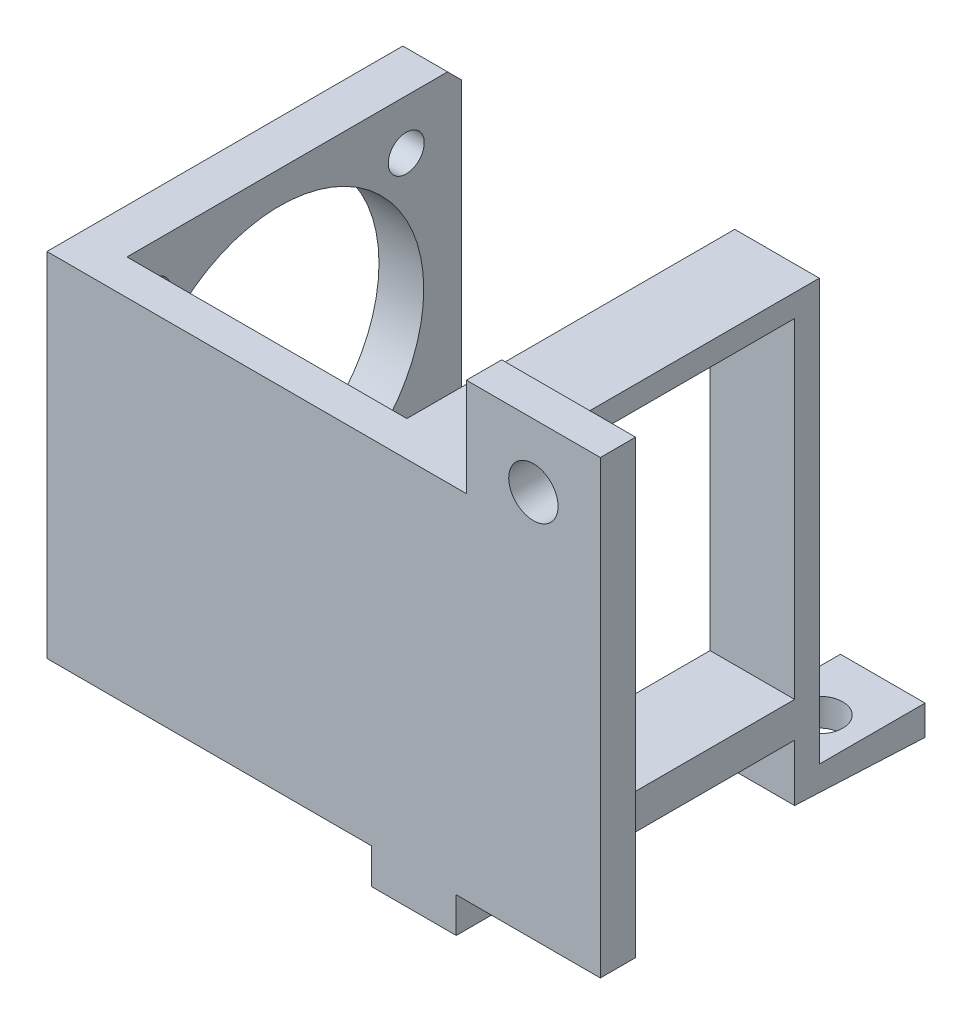
ISO-10303-21;
HEADER;
FILE_DESCRIPTION(('STEP AP214'),'2;1');
FILE_NAME('part.step','',(''),(''),'','','');
FILE_SCHEMA(('AUTOMOTIVE_DESIGN { 1 0 10303 214 1 1 1 1 }'));
ENDSEC;
DATA;
#1=APPLICATION_CONTEXT('core data for automotive mechanical design processes');
#2=APPLICATION_PROTOCOL_DEFINITION('international standard','automotive_design',2000,#1);
#3=PRODUCT_CONTEXT('',#1,'mechanical');
#4=PRODUCT('Part','Part','',(#3));
#5=PRODUCT_RELATED_PRODUCT_CATEGORY('part','',(#4));
#6=PRODUCT_DEFINITION_FORMATION('','',#4);
#7=PRODUCT_DEFINITION_CONTEXT('part definition',#1,'design');
#8=PRODUCT_DEFINITION('design','',#6,#7);
#9=PRODUCT_DEFINITION_SHAPE('','',#8);
#10=(LENGTH_UNIT() NAMED_UNIT(*) SI_UNIT(.MILLI.,.METRE.));
#11=(NAMED_UNIT(*) PLANE_ANGLE_UNIT() SI_UNIT($,.RADIAN.));
#12=(NAMED_UNIT(*) SI_UNIT($,.STERADIAN.) SOLID_ANGLE_UNIT());
#13=UNCERTAINTY_MEASURE_WITH_UNIT(LENGTH_MEASURE(1.E-05),#10,'distance_accuracy_value','');
#14=(GEOMETRIC_REPRESENTATION_CONTEXT(3) GLOBAL_UNCERTAINTY_ASSIGNED_CONTEXT((#13)) GLOBAL_UNIT_ASSIGNED_CONTEXT((#10,
#11,#12)) REPRESENTATION_CONTEXT('',''));
#15=CARTESIAN_POINT('',(0.,0.,0.));
#16=DIRECTION('',(0.,0.,1.));
#17=DIRECTION('',(1.,0.,0.));
#18=AXIS2_PLACEMENT_3D('',#15,#16,#17);
#19=CARTESIAN_POINT('',(0.,0.,0.));
#20=DIRECTION('',(0.,0.,-1.));
#21=DIRECTION('',(-1.,0.,0.));
#22=AXIS2_PLACEMENT_3D('',#19,#20,#21);
#23=PLANE('',#22);
#24=DIRECTION('',(-1.,0.,0.));
#25=VECTOR('',#24,1.);
#26=CARTESIAN_POINT('',(0.,-13.9389851109085,0.));
#27=LINE('',#26,#25);
#28=CARTESIAN_POINT('',(78.5,-13.9389851109085,0.));
#29=VERTEX_POINT('',#28);
#30=CARTESIAN_POINT('',(59.5,-13.9389851109085,0.));
#31=VERTEX_POINT('',#30);
#32=EDGE_CURVE('E473',#29,#31,#27,.T.);
#33=ORIENTED_EDGE('',*,*,#32,.F.);
#34=DIRECTION('',(0.,1.,0.));
#35=VECTOR('',#34,1.);
#36=CARTESIAN_POINT('',(78.5,64.0610148890915,0.));
#37=LINE('',#36,#35);
#38=CARTESIAN_POINT('',(78.5,-77.8779702218171,0.));
#39=VERTEX_POINT('',#38);
#40=EDGE_CURVE('E46',#39,#29,#37,.T.);
#41=ORIENTED_EDGE('',*,*,#40,.F.);
#42=DIRECTION('',(-1.,0.,0.));
#43=VECTOR('',#42,1.);
#44=CARTESIAN_POINT('',(58.0600000000001,-77.8779702218171,0.));
#45=LINE('',#44,#43);
#46=CARTESIAN_POINT('',(58.0600000000001,-77.8779702218171,0.));
#47=VERTEX_POINT('',#46);
#48=EDGE_CURVE('E237',#39,#47,#45,.T.);
#49=ORIENTED_EDGE('',*,*,#48,.T.);
#50=DIRECTION('',(-1.,0.,0.));
#51=VECTOR('',#50,1.);
#52=CARTESIAN_POINT('',(58.0600000000001,-77.8779702218171,0.));
#53=LINE('',#52,#51);
#54=CARTESIAN_POINT('',(46.0600000000001,-77.8779702218171,0.));
#55=VERTEX_POINT('',#54);
#56=EDGE_CURVE('E466',#47,#55,#53,.T.);
#57=ORIENTED_EDGE('',*,*,#56,.T.);
#58=DIRECTION('',(-1.,0.,0.));
#59=VECTOR('',#58,1.);
#60=CARTESIAN_POINT('',(0.,-77.8779702218171,0.));
#61=LINE('',#60,#59);
#62=CARTESIAN_POINT('',(6.35000000000006,-77.8779702218171,0.));
#63=VERTEX_POINT('',#62);
#64=EDGE_CURVE('E299',#55,#63,#61,.T.);
#65=ORIENTED_EDGE('',*,*,#64,.T.);
#66=DIRECTION('',(0.,1.,0.));
#67=VECTOR('',#66,1.);
#68=CARTESIAN_POINT('',(6.35000000000001,-27.8779702218171,0.));
#69=LINE('',#68,#67);
#70=CARTESIAN_POINT('',(6.35000000000001,-27.8779702218171,0.));
#71=VERTEX_POINT('',#70);
#72=EDGE_CURVE('E286',#63,#71,#69,.T.);
#73=ORIENTED_EDGE('',*,*,#72,.T.);
#74=DIRECTION('',(1.,0.,0.));
#75=VECTOR('',#74,1.);
#76=CARTESIAN_POINT('',(59.5,-27.8779702218171,0.));
#77=LINE('',#76,#75);
#78=CARTESIAN_POINT('',(46.06,-27.8779702218171,0.));
#79=VERTEX_POINT('',#78);
#80=EDGE_CURVE('E319',#71,#79,#77,.T.);
#81=ORIENTED_EDGE('',*,*,#80,.T.);
#82=DIRECTION('',(0.,-1.,0.));
#83=VECTOR('',#82,1.);
#84=CARTESIAN_POINT('',(46.06,-27.8779702218171,0.));
#85=LINE('',#84,#83);
#86=CARTESIAN_POINT('',(46.06,-31.0779702218171,0.));
#87=VERTEX_POINT('',#86);
#88=EDGE_CURVE('E403',#79,#87,#85,.T.);
#89=ORIENTED_EDGE('',*,*,#88,.T.);
#90=DIRECTION('',(1.,0.,0.));
#91=VECTOR('',#90,1.);
#92=CARTESIAN_POINT('',(58.06,-31.0779702218171,0.));
#93=LINE('',#92,#91);
#94=CARTESIAN_POINT('',(58.06,-31.0779702218171,0.));
#95=VERTEX_POINT('',#94);
#96=EDGE_CURVE('E401',#87,#95,#93,.T.);
#97=ORIENTED_EDGE('',*,*,#96,.T.);
#98=DIRECTION('',(0.,1.,0.));
#99=VECTOR('',#98,1.);
#100=CARTESIAN_POINT('',(58.06,-27.8779702218171,0.));
#101=LINE('',#100,#99);
#102=CARTESIAN_POINT('',(58.06,-27.8779702218171,0.));
#103=VERTEX_POINT('',#102);
#104=EDGE_CURVE('E397',#95,#103,#101,.T.);
#105=ORIENTED_EDGE('',*,*,#104,.T.);
#106=CARTESIAN_POINT('',(59.5,-27.8779702218171,0.));
#107=VERTEX_POINT('',#106);
#108=EDGE_CURVE('E296',#103,#107,#77,.T.);
#109=ORIENTED_EDGE('',*,*,#108,.T.);
#110=DIRECTION('',(0.,-1.,0.));
#111=VECTOR('',#110,1.);
#112=CARTESIAN_POINT('',(59.5,-13.9389851109085,0.));
#113=LINE('',#112,#111);
#114=EDGE_CURVE('E379',#31,#107,#113,.T.);
#115=ORIENTED_EDGE('',*,*,#114,.F.);
#116=EDGE_LOOP('',(#33,#41,#49,#57,#65,#73,#81,#89,#97,#105,#109,#115));
#117=FACE_BOUND('',#116,.T.);
#118=CARTESIAN_POINT('',(69.,-22.9389851109085,0.));
#119=DIRECTION('',(0.,0.,1.));
#120=DIRECTION('',(-1.,0.,0.));
#121=AXIS2_PLACEMENT_3D('',#118,#119,#120);
#122=CIRCLE('',#121,3.50000000000001);
#123=CARTESIAN_POINT('',(65.5,-22.9389851109085,0.));
#124=VERTEX_POINT('',#123);
#125=EDGE_CURVE('E239',#124,#124,#122,.T.);
#126=ORIENTED_EDGE('',*,*,#125,.T.);
#127=EDGE_LOOP('',(#126));
#128=FACE_BOUND('',#127,.T.);
#129=ADVANCED_FACE('F42',(#117,#128),#23,.T.);
#130=CARTESIAN_POINT('',(59.5,-13.9389851109085,5.));
#131=DIRECTION('',(1.,0.,0.));
#132=DIRECTION('',(0.,0.,-1.));
#133=AXIS2_PLACEMENT_3D('',#130,#131,#132);
#134=PLANE('',#133);
#135=DIRECTION('',(0.,-1.,0.));
#136=VECTOR('',#135,1.);
#137=CARTESIAN_POINT('',(59.5,-13.9389851109085,5.));
#138=LINE('',#137,#136);
#139=CARTESIAN_POINT('',(59.5,-13.9389851109085,5.));
#140=VERTEX_POINT('',#139);
#141=CARTESIAN_POINT('',(59.5,-27.8779702218171,5.));
#142=VERTEX_POINT('',#141);
#143=EDGE_CURVE('E52',#140,#142,#138,.T.);
#144=ORIENTED_EDGE('',*,*,#143,.F.);
#145=DIRECTION('',(0.,0.,-1.));
#146=VECTOR('',#145,1.);
#147=CARTESIAN_POINT('',(59.5,-13.9389851109085,5.));
#148=LINE('',#147,#146);
#149=EDGE_CURVE('E60',#140,#31,#148,.T.);
#150=ORIENTED_EDGE('',*,*,#149,.T.);
#151=ORIENTED_EDGE('',*,*,#114,.T.);
#152=DIRECTION('',(0.,0.,-1.));
#153=VECTOR('',#152,1.);
#154=CARTESIAN_POINT('',(59.5,-27.8779702218171,5.));
#155=LINE('',#154,#153);
#156=EDGE_CURVE('E347',#142,#107,#155,.T.);
#157=ORIENTED_EDGE('',*,*,#156,.F.);
#158=EDGE_LOOP('',(#144,#150,#151,#157));
#159=FACE_BOUND('',#158,.T.);
#160=ADVANCED_FACE('F44',(#159),#134,.F.);
#161=CARTESIAN_POINT('',(78.5,64.0610148890915,5.));
#162=DIRECTION('',(-1.,0.,0.));
#163=DIRECTION('',(0.,-1.,0.));
#164=AXIS2_PLACEMENT_3D('',#161,#162,#163);
#165=PLANE('',#164);
#166=ORIENTED_EDGE('',*,*,#40,.T.);
#167=DIRECTION('',(0.,0.,1.));
#168=VECTOR('',#167,1.);
#169=CARTESIAN_POINT('',(78.5,-13.9389851109085,-61.5));
#170=LINE('',#169,#168);
#171=CARTESIAN_POINT('',(78.5,-13.9389851109085,5.));
#172=VERTEX_POINT('',#171);
#173=EDGE_CURVE('E208',#29,#172,#170,.T.);
#174=ORIENTED_EDGE('',*,*,#173,.T.);
#175=DIRECTION('',(0.,1.,0.));
#176=VECTOR('',#175,1.);
#177=CARTESIAN_POINT('',(78.5,64.0610148890915,5.));
#178=LINE('',#177,#176);
#179=CARTESIAN_POINT('',(78.5000000000001,-77.8779702218171,5.));
#180=VERTEX_POINT('',#179);
#181=EDGE_CURVE('E11',#180,#172,#178,.T.);
#182=ORIENTED_EDGE('',*,*,#181,.F.);
#183=DIRECTION('',(0.,0.,-1.));
#184=VECTOR('',#183,1.);
#185=CARTESIAN_POINT('',(78.5000000000001,-77.8779702218171,5.001));
#186=LINE('',#185,#184);
#187=EDGE_CURVE('E234',#180,#39,#186,.T.);
#188=ORIENTED_EDGE('',*,*,#187,.T.);
#189=EDGE_LOOP('',(#166,#174,#182,#188));
#190=FACE_BOUND('',#189,.T.);
#191=ADVANCED_FACE('F216',(#190),#165,.F.);
#192=CARTESIAN_POINT('',(0.,0.,5.));
#193=DIRECTION('',(0.,0.,-1.));
#194=DIRECTION('',(-1.,0.,0.));
#195=AXIS2_PLACEMENT_3D('',#192,#193,#194);
#196=PLANE('',#195);
#197=ORIENTED_EDGE('',*,*,#181,.T.);
#198=DIRECTION('',(1.,0.,0.));
#199=VECTOR('',#198,1.);
#200=CARTESIAN_POINT('',(78.5,-13.9389851109085,5.));
#201=LINE('',#200,#199);
#202=EDGE_CURVE('E205',#140,#172,#201,.T.);
#203=ORIENTED_EDGE('',*,*,#202,.F.);
#204=ORIENTED_EDGE('',*,*,#143,.T.);
#205=DIRECTION('',(1.,0.,0.));
#206=VECTOR('',#205,1.);
#207=CARTESIAN_POINT('',(59.5,-27.8779702218171,5.));
#208=LINE('',#207,#206);
#209=CARTESIAN_POINT('',(0.,-27.8779702218171,5.));
#210=VERTEX_POINT('',#209);
#211=EDGE_CURVE('E231',#210,#142,#208,.T.);
#212=ORIENTED_EDGE('',*,*,#211,.F.);
#213=DIRECTION('',(0.,1.,0.));
#214=VECTOR('',#213,1.);
#215=CARTESIAN_POINT('',(0.,-27.8779702218171,5.));
#216=LINE('',#215,#214);
#217=CARTESIAN_POINT('',(0.,-77.8779702218171,5.));
#218=VERTEX_POINT('',#217);
#219=EDGE_CURVE('E315',#218,#210,#216,.T.);
#220=ORIENTED_EDGE('',*,*,#219,.F.);
#221=DIRECTION('',(-1.,0.,0.));
#222=VECTOR('',#221,1.);
#223=CARTESIAN_POINT('',(0.,-77.8779702218171,5.));
#224=LINE('',#223,#222);
#225=CARTESIAN_POINT('',(46.0600000000001,-77.8779702218171,5.));
#226=VERTEX_POINT('',#225);
#227=EDGE_CURVE('E311',#226,#218,#224,.T.);
#228=ORIENTED_EDGE('',*,*,#227,.F.);
#229=DIRECTION('',(0.,1.,0.));
#230=VECTOR('',#229,1.);
#231=CARTESIAN_POINT('',(46.0600000000001,-82.8779702218171,5.));
#232=LINE('',#231,#230);
#233=CARTESIAN_POINT('',(46.0600000000001,-82.8779702218171,5.));
#234=VERTEX_POINT('',#233);
#235=EDGE_CURVE('E307',#234,#226,#232,.T.);
#236=ORIENTED_EDGE('',*,*,#235,.F.);
#237=DIRECTION('',(-1.,0.,0.));
#238=VECTOR('',#237,1.);
#239=CARTESIAN_POINT('',(58.0600000000001,-82.8779702218171,5.));
#240=LINE('',#239,#238);
#241=CARTESIAN_POINT('',(58.0600000000001,-82.8779702218171,5.));
#242=VERTEX_POINT('',#241);
#243=EDGE_CURVE('E303',#242,#234,#240,.T.);
#244=ORIENTED_EDGE('',*,*,#243,.F.);
#245=DIRECTION('',(0.,-1.,0.));
#246=VECTOR('',#245,1.);
#247=CARTESIAN_POINT('',(58.0600000000001,-77.8779702218171,5.));
#248=LINE('',#247,#246);
#249=CARTESIAN_POINT('',(58.0600000000001,-77.8779702218171,5.));
#250=VERTEX_POINT('',#249);
#251=EDGE_CURVE('E226',#250,#242,#248,.T.);
#252=ORIENTED_EDGE('',*,*,#251,.F.);
#253=DIRECTION('',(-1.,0.,0.));
#254=VECTOR('',#253,1.);
#255=CARTESIAN_POINT('',(58.0600000000001,-77.8779702218171,5.));
#256=LINE('',#255,#254);
#257=EDGE_CURVE('E224',#180,#250,#256,.T.);
#258=ORIENTED_EDGE('',*,*,#257,.F.);
#259=EDGE_LOOP('',(#197,#203,#204,#212,#220,#228,#236,#244,#252,#258));
#260=FACE_BOUND('',#259,.T.);
#261=CARTESIAN_POINT('',(69.,-22.9389851109085,5.));
#262=DIRECTION('',(0.,0.,1.));
#263=DIRECTION('',(-1.,0.,0.));
#264=AXIS2_PLACEMENT_3D('',#261,#262,#263);
#265=CIRCLE('',#264,3.50000000000001);
#266=CARTESIAN_POINT('',(65.5,-22.9389851109085,5.));
#267=VERTEX_POINT('',#266);
#268=EDGE_CURVE('E245',#267,#267,#265,.F.);
#269=ORIENTED_EDGE('',*,*,#268,.T.);
#270=EDGE_LOOP('',(#269));
#271=FACE_BOUND('',#270,.T.);
#272=ADVANCED_FACE('F221',(#260,#271),#196,.F.);
#273=CARTESIAN_POINT('',(46.0600000000001,-103.503401305862,-43.));
#274=DIRECTION('',(0.,0.,-1.));
#275=DIRECTION('',(-1.,0.,0.));
#276=AXIS2_PLACEMENT_3D('',#273,#274,#275);
#277=PLANE('',#276);
#278=DIRECTION('',(1.,0.,0.));
#279=VECTOR('',#278,1.);
#280=CARTESIAN_POINT('',(58.0600000000001,-82.8779702218171,-43.));
#281=LINE('',#280,#279);
#282=CARTESIAN_POINT('',(46.0600000000001,-82.8779702218171,-43.));
#283=VERTEX_POINT('',#282);
#284=CARTESIAN_POINT('',(58.0600000000001,-82.8779702218171,-43.));
#285=VERTEX_POINT('',#284);
#286=EDGE_CURVE('E460',#283,#285,#281,.T.);
#287=ORIENTED_EDGE('',*,*,#286,.F.);
#288=DIRECTION('',(0.,1.,0.));
#289=VECTOR('',#288,1.);
#290=CARTESIAN_POINT('',(46.0600000000001,-103.503401305862,-43.));
#291=LINE('',#290,#289);
#292=CARTESIAN_POINT('',(46.0600000000001,-90.9199987527819,-43.));
#293=VERTEX_POINT('',#292);
#294=EDGE_CURVE('E455',#293,#283,#291,.T.);
#295=ORIENTED_EDGE('',*,*,#294,.F.);
#296=DIRECTION('',(1.,0.,0.));
#297=VECTOR('',#296,1.);
#298=CARTESIAN_POINT('',(46.0600000000001,-90.9199987527819,-43.));
#299=LINE('',#298,#297);
#300=CARTESIAN_POINT('',(58.0600000000001,-90.9199987527819,-43.));
#301=VERTEX_POINT('',#300);
#302=EDGE_CURVE('E548',#293,#301,#299,.T.);
#303=ORIENTED_EDGE('',*,*,#302,.T.);
#304=DIRECTION('',(0.,1.,0.));
#305=VECTOR('',#304,1.);
#306=CARTESIAN_POINT('',(58.0600000000001,-103.503401305862,-43.));
#307=LINE('',#306,#305);
#308=EDGE_CURVE('E558',#301,#285,#307,.T.);
#309=ORIENTED_EDGE('',*,*,#308,.T.);
#310=EDGE_LOOP('',(#287,#295,#303,#309));
#311=FACE_BOUND('',#310,.T.);
#312=ADVANCED_FACE('F589',(#311),#277,.F.);
#313=DIRECTION('',(-1.,0.,0.));
#314=VECTOR('',#313,1.);
#315=CARTESIAN_POINT('',(58.0600000000001,-77.8779702218171,-43.));
#316=LINE('',#315,#314);
#317=CARTESIAN_POINT('',(58.0600000000001,-77.8779702218171,-43.));
#318=VERTEX_POINT('',#317);
#319=CARTESIAN_POINT('',(46.0600000000001,-77.8779702218171,-43.));
#320=VERTEX_POINT('',#319);
#321=EDGE_CURVE('E478',#318,#320,#316,.T.);
#322=ORIENTED_EDGE('',*,*,#321,.F.);
#323=CARTESIAN_POINT('',(58.06,-31.0779702218171,-43.));
#324=VERTEX_POINT('',#323);
#325=EDGE_CURVE('E557',#318,#324,#307,.T.);
#326=ORIENTED_EDGE('',*,*,#325,.T.);
#327=DIRECTION('',(1.,0.,0.));
#328=VECTOR('',#327,1.);
#329=CARTESIAN_POINT('',(46.06,-31.0779702218171,-43.));
#330=LINE('',#329,#328);
#331=CARTESIAN_POINT('',(46.06,-31.0779702218171,-43.));
#332=VERTEX_POINT('',#331);
#333=EDGE_CURVE('E543',#332,#324,#330,.T.);
#334=ORIENTED_EDGE('',*,*,#333,.F.);
#335=EDGE_CURVE('E561',#320,#332,#291,.T.);
#336=ORIENTED_EDGE('',*,*,#335,.F.);
#337=EDGE_LOOP('',(#322,#326,#334,#336));
#338=FACE_BOUND('',#337,.T.);
#339=ADVANCED_FACE('F591',(#338),#277,.F.);
#340=CARTESIAN_POINT('',(0.,-27.8779702218171,-46.5));
#341=DIRECTION('',(0.,0.,1.));
#342=DIRECTION('',(1.,0.,0.));
#343=AXIS2_PLACEMENT_3D('',#340,#341,#342);
#344=PLANE('',#343);
#345=DIRECTION('',(-1.,0.,0.));
#346=VECTOR('',#345,1.);
#347=CARTESIAN_POINT('',(58.0600000000001,-87.5746130747019,-46.5));
#348=LINE('',#347,#346);
#349=CARTESIAN_POINT('',(58.0600000000001,-87.5746130747019,-46.5));
#350=VERTEX_POINT('',#349);
#351=CARTESIAN_POINT('',(46.0600000000001,-87.5746130747019,-46.5));
#352=VERTEX_POINT('',#351);
#353=EDGE_CURVE('E522',#350,#352,#348,.T.);
#354=ORIENTED_EDGE('',*,*,#353,.T.);
#355=DIRECTION('',(0.,-1.,0.));
#356=VECTOR('',#355,1.);
#357=CARTESIAN_POINT('',(46.06,-27.8779702218171,-46.5));
#358=LINE('',#357,#356);
#359=CARTESIAN_POINT('',(46.06,-27.8779702218171,-46.5));
#360=VERTEX_POINT('',#359);
#361=EDGE_CURVE('E412',#360,#352,#358,.T.);
#362=ORIENTED_EDGE('',*,*,#361,.F.);
#363=DIRECTION('',(-1.,0.,0.));
#364=VECTOR('',#363,1.);
#365=CARTESIAN_POINT('',(58.06,-27.8779702218171,-46.5));
#366=LINE('',#365,#364);
#367=CARTESIAN_POINT('',(58.06,-27.8779702218171,-46.5));
#368=VERTEX_POINT('',#367);
#369=EDGE_CURVE('E429',#368,#360,#366,.T.);
#370=ORIENTED_EDGE('',*,*,#369,.F.);
#371=DIRECTION('',(0.,1.,0.));
#372=VECTOR('',#371,1.);
#373=CARTESIAN_POINT('',(58.06,-27.8779702218171,-46.5));
#374=LINE('',#373,#372);
#375=EDGE_CURVE('E417',#350,#368,#374,.T.);
#376=ORIENTED_EDGE('',*,*,#375,.F.);
#377=EDGE_LOOP('',(#354,#362,#370,#376));
#378=FACE_BOUND('',#377,.T.);
#379=ADVANCED_FACE('F572',(#378),#344,.F.);
#380=CARTESIAN_POINT('',(58.06,-31.0779702218171,-46.5));
#381=DIRECTION('',(0.,1.,0.));
#382=DIRECTION('',(0.,0.,-1.));
#383=AXIS2_PLACEMENT_3D('',#380,#381,#382);
#384=PLANE('',#383);
#385=ORIENTED_EDGE('',*,*,#333,.T.);
#386=DIRECTION('',(0.,0.,1.));
#387=VECTOR('',#386,1.);
#388=CARTESIAN_POINT('',(58.06,-31.0779702218171,-46.5));
#389=LINE('',#388,#387);
#390=EDGE_CURVE('E418',#324,#95,#389,.T.);
#391=ORIENTED_EDGE('',*,*,#390,.T.);
#392=ORIENTED_EDGE('',*,*,#96,.F.);
#393=DIRECTION('',(0.,0.,1.));
#394=VECTOR('',#393,1.);
#395=CARTESIAN_POINT('',(46.06,-31.0779702218171,-46.5));
#396=LINE('',#395,#394);
#397=EDGE_CURVE('E421',#332,#87,#396,.T.);
#398=ORIENTED_EDGE('',*,*,#397,.F.);
#399=EDGE_LOOP('',(#385,#391,#392,#398));
#400=FACE_BOUND('',#399,.T.);
#401=ADVANCED_FACE('F818',(#400),#384,.F.);
#402=CARTESIAN_POINT('',(59.5,-27.8779702218171,5.));
#403=DIRECTION('',(0.,-1.,0.));
#404=DIRECTION('',(-1.,0.,0.));
#405=AXIS2_PLACEMENT_3D('',#402,#403,#404);
#406=PLANE('',#405);
#407=DIRECTION('',(0.,0.,-1.));
#408=VECTOR('',#407,1.);
#409=CARTESIAN_POINT('',(0.,-27.8779702218171,5.));
#410=LINE('',#409,#408);
#411=CARTESIAN_POINT('',(0.,-27.8779702218171,-45.48));
#412=VERTEX_POINT('',#411);
#413=EDGE_CURVE('E318',#210,#412,#410,.T.);
#414=ORIENTED_EDGE('',*,*,#413,.F.);
#415=ORIENTED_EDGE('',*,*,#211,.T.);
#416=ORIENTED_EDGE('',*,*,#156,.T.);
#417=ORIENTED_EDGE('',*,*,#108,.F.);
#418=DIRECTION('',(0.,0.,1.));
#419=VECTOR('',#418,1.);
#420=CARTESIAN_POINT('',(58.06,-27.8779702218171,-46.5));
#421=LINE('',#420,#419);
#422=EDGE_CURVE('E240',#368,#103,#421,.T.);
#423=ORIENTED_EDGE('',*,*,#422,.F.);
#424=ORIENTED_EDGE('',*,*,#369,.T.);
#425=DIRECTION('',(0.,0.,1.));
#426=VECTOR('',#425,1.);
#427=CARTESIAN_POINT('',(46.06,-27.8779702218171,-46.5));
#428=LINE('',#427,#426);
#429=EDGE_CURVE('E247',#360,#79,#428,.T.);
#430=ORIENTED_EDGE('',*,*,#429,.T.);
#431=ORIENTED_EDGE('',*,*,#80,.F.);
#432=DIRECTION('',(0.,0.,1.));
#433=VECTOR('',#432,1.);
#434=CARTESIAN_POINT('',(6.35000000000001,-27.8779702218171,-52.48));
#435=LINE('',#434,#433);
#436=CARTESIAN_POINT('',(6.35000000000001,-27.8779702218171,-45.48));
#437=VERTEX_POINT('',#436);
#438=EDGE_CURVE('E290',#437,#71,#435,.T.);
#439=ORIENTED_EDGE('',*,*,#438,.F.);
#440=DIRECTION('',(1.,0.,0.));
#441=VECTOR('',#440,1.);
#442=CARTESIAN_POINT('',(59.5,-27.8779702218171,-45.48));
#443=LINE('',#442,#441);
#444=EDGE_CURVE('E351',#412,#437,#443,.T.);
#445=ORIENTED_EDGE('',*,*,#444,.F.);
#446=EDGE_LOOP('',(#414,#415,#416,#417,#423,#424,#430,#431,#439,#445));
#447=FACE_BOUND('',#446,.T.);
#448=ADVANCED_FACE('F391',(#447),#406,.F.);
#449=CARTESIAN_POINT('',(58.0600000000001,-77.8779702218171,5.));
#450=DIRECTION('',(0.,1.,0.));
#451=DIRECTION('',(1.,0.,0.));
#452=AXIS2_PLACEMENT_3D('',#449,#450,#451);
#453=PLANE('',#452);
#454=ORIENTED_EDGE('',*,*,#48,.F.);
#455=ORIENTED_EDGE('',*,*,#187,.F.);
#456=ORIENTED_EDGE('',*,*,#257,.T.);
#457=DIRECTION('',(0.,0.,-1.));
#458=VECTOR('',#457,1.);
#459=CARTESIAN_POINT('',(58.0600000000001,-77.8779702218171,5.));
#460=LINE('',#459,#458);
#461=EDGE_CURVE('E344',#250,#47,#460,.T.);
#462=ORIENTED_EDGE('',*,*,#461,.T.);
#463=EDGE_LOOP('',(#454,#455,#456,#462));
#464=FACE_BOUND('',#463,.T.);
#465=ADVANCED_FACE('F235',(#464),#453,.F.);
#466=CARTESIAN_POINT('',(58.0600000000001,-77.8779702218171,5.));
#467=DIRECTION('',(-1.,0.,0.));
#468=DIRECTION('',(0.,0.,1.));
#469=AXIS2_PLACEMENT_3D('',#466,#467,#468);
#470=PLANE('',#469);
#471=ORIENTED_EDGE('',*,*,#461,.F.);
#472=ORIENTED_EDGE('',*,*,#251,.T.);
#473=DIRECTION('',(0.,0.,-1.));
#474=VECTOR('',#473,1.);
#475=CARTESIAN_POINT('',(58.0600000000001,-82.8779702218171,5.));
#476=LINE('',#475,#474);
#477=EDGE_CURVE('E68',#242,#285,#476,.T.);
#478=ORIENTED_EDGE('',*,*,#477,.T.);
#479=ORIENTED_EDGE('',*,*,#308,.F.);
#480=DIRECTION('',(0.,-0.044132479785462,-0.999025687471541));
#481=VECTOR('',#480,1.);
#482=CARTESIAN_POINT('',(58.0600000000001,-91.0988203244152,-47.0479788220425));
#483=LINE('',#482,#481);
#484=CARTESIAN_POINT('',(58.0600000000002,-91.074613074702,-46.5));
#485=VERTEX_POINT('',#484);
#486=EDGE_CURVE('E544',#301,#485,#483,.T.);
#487=ORIENTED_EDGE('',*,*,#486,.T.);
#488=DIRECTION('',(0.,-0.0479447993683981,-0.99884998684163));
#489=VECTOR('',#488,1.);
#490=CARTESIAN_POINT('',(58.0600000000002,-91.074613074702,-46.5));
#491=LINE('',#490,#489);
#492=CARTESIAN_POINT('',(58.0600000000001,-91.7946130747019,-61.5));
#493=VERTEX_POINT('',#492);
#494=EDGE_CURVE('E515',#485,#493,#491,.T.);
#495=ORIENTED_EDGE('',*,*,#494,.T.);
#496=DIRECTION('',(0.,1.,0.));
#497=VECTOR('',#496,1.);
#498=CARTESIAN_POINT('',(58.0600000000001,-91.0746130747019,-61.5));
#499=LINE('',#498,#497);
#500=CARTESIAN_POINT('',(58.0600000000001,-87.5746130747019,-61.5));
#501=VERTEX_POINT('',#500);
#502=EDGE_CURVE('E523',#493,#501,#499,.T.);
#503=ORIENTED_EDGE('',*,*,#502,.T.);
#504=DIRECTION('',(0.,0.,1.));
#505=VECTOR('',#504,1.);
#506=CARTESIAN_POINT('',(58.0600000000001,-87.5746130747019,-61.5));
#507=LINE('',#506,#505);
#508=EDGE_CURVE('E540',#501,#350,#507,.T.);
#509=ORIENTED_EDGE('',*,*,#508,.T.);
#510=ORIENTED_EDGE('',*,*,#375,.T.);
#511=ORIENTED_EDGE('',*,*,#422,.T.);
#512=ORIENTED_EDGE('',*,*,#104,.F.);
#513=ORIENTED_EDGE('',*,*,#390,.F.);
#514=ORIENTED_EDGE('',*,*,#325,.F.);
#515=DIRECTION('',(0.,0.,1.));
#516=VECTOR('',#515,1.);
#517=CARTESIAN_POINT('',(58.0600000000001,-77.8779702218171,-61.502));
#518=LINE('',#517,#516);
#519=EDGE_CURVE('E463',#318,#47,#518,.T.);
#520=ORIENTED_EDGE('',*,*,#519,.T.);
#521=EDGE_LOOP('',(#471,#472,#478,#479,#487,#495,#503,#509,#510,#511,#512,#513,#514,#520));
#522=FACE_BOUND('',#521,.T.);
#523=ADVANCED_FACE('F461',(#522),#470,.F.);
#524=CARTESIAN_POINT('',(58.0600000000001,-82.8779702218171,5.));
#525=DIRECTION('',(0.,1.,0.));
#526=DIRECTION('',(1.,0.,0.));
#527=AXIS2_PLACEMENT_3D('',#524,#525,#526);
#528=PLANE('',#527);
#529=ORIENTED_EDGE('',*,*,#477,.F.);
#530=ORIENTED_EDGE('',*,*,#243,.T.);
#531=DIRECTION('',(0.,0.,-1.));
#532=VECTOR('',#531,1.);
#533=CARTESIAN_POINT('',(46.0600000000001,-82.8779702218171,5.));
#534=LINE('',#533,#532);
#535=EDGE_CURVE('E339',#234,#283,#534,.T.);
#536=ORIENTED_EDGE('',*,*,#535,.T.);
#537=ORIENTED_EDGE('',*,*,#286,.T.);
#538=EDGE_LOOP('',(#529,#530,#536,#537));
#539=FACE_BOUND('',#538,.T.);
#540=ADVANCED_FACE('F459',(#539),#528,.F.);
#541=CARTESIAN_POINT('',(46.0600000000001,-82.8779702218171,5.));
#542=DIRECTION('',(1.,0.,0.));
#543=DIRECTION('',(0.,-1.,0.));
#544=AXIS2_PLACEMENT_3D('',#541,#542,#543);
#545=PLANE('',#544);
#546=ORIENTED_EDGE('',*,*,#535,.F.);
#547=ORIENTED_EDGE('',*,*,#235,.T.);
#548=DIRECTION('',(0.,0.,-1.));
#549=VECTOR('',#548,1.);
#550=CARTESIAN_POINT('',(46.0600000000001,-77.8779702218171,5.));
#551=LINE('',#550,#549);
#552=EDGE_CURVE('E335',#226,#55,#551,.T.);
#553=ORIENTED_EDGE('',*,*,#552,.T.);
#554=DIRECTION('',(0.,0.,1.));
#555=VECTOR('',#554,1.);
#556=CARTESIAN_POINT('',(46.0600000000001,-77.8779702218171,-61.502));
#557=LINE('',#556,#555);
#558=EDGE_CURVE('E469',#320,#55,#557,.T.);
#559=ORIENTED_EDGE('',*,*,#558,.F.);
#560=ORIENTED_EDGE('',*,*,#335,.T.);
#561=ORIENTED_EDGE('',*,*,#397,.T.);
#562=ORIENTED_EDGE('',*,*,#88,.F.);
#563=ORIENTED_EDGE('',*,*,#429,.F.);
#564=ORIENTED_EDGE('',*,*,#361,.T.);
#565=DIRECTION('',(0.,0.,1.));
#566=VECTOR('',#565,1.);
#567=CARTESIAN_POINT('',(46.0600000000001,-87.5746130747019,-61.5));
#568=LINE('',#567,#566);
#569=CARTESIAN_POINT('',(46.0600000000001,-87.5746130747019,-61.5));
#570=VERTEX_POINT('',#569);
#571=EDGE_CURVE('E534',#570,#352,#568,.T.);
#572=ORIENTED_EDGE('',*,*,#571,.F.);
#573=DIRECTION('',(0.,-1.,0.));
#574=VECTOR('',#573,1.);
#575=CARTESIAN_POINT('',(46.0600000000001,-91.0746130747019,-61.5));
#576=LINE('',#575,#574);
#577=CARTESIAN_POINT('',(46.0600000000001,-91.794613074702,-61.5));
#578=VERTEX_POINT('',#577);
#579=EDGE_CURVE('E530',#570,#578,#576,.T.);
#580=ORIENTED_EDGE('',*,*,#579,.T.);
#581=DIRECTION('',(0.,0.0479447993683981,0.99884998684163));
#582=VECTOR('',#581,1.);
#583=CARTESIAN_POINT('',(46.0600000000001,-91.074613074702,-46.5));
#584=LINE('',#583,#582);
#585=CARTESIAN_POINT('',(46.0600000000001,-91.074613074702,-46.5));
#586=VERTEX_POINT('',#585);
#587=EDGE_CURVE('E511',#578,#586,#584,.T.);
#588=ORIENTED_EDGE('',*,*,#587,.T.);
#589=DIRECTION('',(0.,0.044132479785462,0.999025687471541));
#590=VECTOR('',#589,1.);
#591=CARTESIAN_POINT('',(46.0600000000001,-91.0988203244152,-47.0479788220425));
#592=LINE('',#591,#590);
#593=EDGE_CURVE('E409',#586,#293,#592,.T.);
#594=ORIENTED_EDGE('',*,*,#593,.T.);
#595=ORIENTED_EDGE('',*,*,#294,.T.);
#596=EDGE_LOOP('',(#546,#547,#553,#559,#560,#561,#562,#563,#564,#572,#580,#588,#594,#595));
#597=FACE_BOUND('',#596,.T.);
#598=ADVANCED_FACE('F434',(#597),#545,.F.);
#599=CARTESIAN_POINT('',(0.,-77.8779702218171,5.));
#600=DIRECTION('',(0.,1.,0.));
#601=DIRECTION('',(1.,0.,0.));
#602=AXIS2_PLACEMENT_3D('',#599,#600,#601);
#603=PLANE('',#602);
#604=DIRECTION('',(0.,0.,1.));
#605=VECTOR('',#604,1.);
#606=CARTESIAN_POINT('',(6.35000000000006,-77.8779702218171,-52.48));
#607=LINE('',#606,#605);
#608=CARTESIAN_POINT('',(6.35000000000006,-77.8779702218171,-45.48));
#609=VERTEX_POINT('',#608);
#610=EDGE_CURVE('E293',#609,#63,#607,.T.);
#611=ORIENTED_EDGE('',*,*,#610,.T.);
#612=ORIENTED_EDGE('',*,*,#64,.F.);
#613=ORIENTED_EDGE('',*,*,#552,.F.);
#614=ORIENTED_EDGE('',*,*,#227,.T.);
#615=DIRECTION('',(0.,0.,-1.));
#616=VECTOR('',#615,1.);
#617=CARTESIAN_POINT('',(0.,-77.8779702218171,5.));
#618=LINE('',#617,#616);
#619=CARTESIAN_POINT('',(0.,-77.8779702218171,-45.48));
#620=VERTEX_POINT('',#619);
#621=EDGE_CURVE('E331',#218,#620,#618,.T.);
#622=ORIENTED_EDGE('',*,*,#621,.T.);
#623=DIRECTION('',(-1.,0.,0.));
#624=VECTOR('',#623,1.);
#625=CARTESIAN_POINT('',(0.,-77.8779702218171,-45.48));
#626=LINE('',#625,#624);
#627=EDGE_CURVE('E375',#609,#620,#626,.T.);
#628=ORIENTED_EDGE('',*,*,#627,.F.);
#629=EDGE_LOOP('',(#611,#612,#613,#614,#622,#628));
#630=FACE_BOUND('',#629,.T.);
#631=ADVANCED_FACE('F452',(#630),#603,.F.);
#632=CARTESIAN_POINT('',(0.,-27.8779702218171,5.));
#633=DIRECTION('',(1.,0.,0.));
#634=DIRECTION('',(0.,0.,-1.));
#635=AXIS2_PLACEMENT_3D('',#632,#633,#634);
#636=PLANE('',#635);
#637=CARTESIAN_POINT('',(0.,-34.9229702218172,-3.70499999999993));
#638=DIRECTION('',(-1.,0.,0.));
#639=DIRECTION('',(0.,1.,0.));
#640=AXIS2_PLACEMENT_3D('',#637,#638,#639);
#641=CIRCLE('',#640,2.555);
#642=CARTESIAN_POINT('',(0.,-32.3679702218172,-3.70499999999992));
#643=VERTEX_POINT('',#642);
#644=EDGE_CURVE('E491',#643,#643,#641,.F.);
#645=ORIENTED_EDGE('',*,*,#644,.T.);
#646=EDGE_LOOP('',(#645));
#647=FACE_BOUND('',#646,.T.);
#648=CARTESIAN_POINT('',(0.,-70.8429702218171,-39.6150000000001));
#649=DIRECTION('',(-1.,0.,0.));
#650=DIRECTION('',(0.,1.,0.));
#651=AXIS2_PLACEMENT_3D('',#648,#649,#650);
#652=CIRCLE('',#651,2.555);
#653=CARTESIAN_POINT('',(0.,-68.287970221817,-39.6150000000001));
#654=VERTEX_POINT('',#653);
#655=EDGE_CURVE('E499',#654,#654,#652,.F.);
#656=ORIENTED_EDGE('',*,*,#655,.T.);
#657=EDGE_LOOP('',(#656));
#658=FACE_BOUND('',#657,.T.);
#659=CARTESIAN_POINT('',(0.,-34.9229702218171,-39.615));
#660=DIRECTION('',(-1.,0.,0.));
#661=DIRECTION('',(0.,0.,-1.));
#662=AXIS2_PLACEMENT_3D('',#659,#660,#661);
#663=CIRCLE('',#662,2.555);
#664=CARTESIAN_POINT('',(0.,-34.9229702218171,-42.17));
#665=VERTEX_POINT('',#664);
#666=EDGE_CURVE('E260',#665,#665,#663,.F.);
#667=ORIENTED_EDGE('',*,*,#666,.T.);
#668=EDGE_LOOP('',(#667));
#669=FACE_BOUND('',#668,.T.);
#670=CARTESIAN_POINT('',(0.,-70.8329702218171,-3.695));
#671=DIRECTION('',(-1.,0.,0.));
#672=DIRECTION('',(0.,0.,-1.));
#673=AXIS2_PLACEMENT_3D('',#670,#671,#672);
#674=CIRCLE('',#673,2.555);
#675=CARTESIAN_POINT('',(0.,-70.8329702218171,-6.24999999999999));
#676=VERTEX_POINT('',#675);
#677=EDGE_CURVE('E259',#676,#676,#674,.F.);
#678=ORIENTED_EDGE('',*,*,#677,.T.);
#679=EDGE_LOOP('',(#678));
#680=FACE_BOUND('',#679,.T.);
#681=CARTESIAN_POINT('',(0.,-52.8779702218171,-21.66));
#682=DIRECTION('',(-1.,0.,0.));
#683=DIRECTION('',(0.,0.,-1.));
#684=AXIS2_PLACEMENT_3D('',#681,#682,#683);
#685=CIRCLE('',#684,20.44);
#686=CARTESIAN_POINT('',(0.,-52.8779702218171,-42.1));
#687=VERTEX_POINT('',#686);
#688=EDGE_CURVE('E282',#687,#687,#685,.F.);
#689=ORIENTED_EDGE('',*,*,#688,.T.);
#690=EDGE_LOOP('',(#689));
#691=FACE_BOUND('',#690,.T.);
#692=DIRECTION('',(0.,-1.,0.));
#693=VECTOR('',#692,1.);
#694=CARTESIAN_POINT('',(0.,-77.8779702218171,-47.48));
#695=LINE('',#694,#693);
#696=CARTESIAN_POINT('',(0.,-29.8779702218171,-47.48));
#697=VERTEX_POINT('',#696);
#698=CARTESIAN_POINT('',(0.,-75.8779702218171,-47.48));
#699=VERTEX_POINT('',#698);
#700=EDGE_CURVE('E254',#697,#699,#695,.T.);
#701=ORIENTED_EDGE('',*,*,#700,.T.);
#702=DIRECTION('',(0.,-0.707106781186543,0.707106781186552));
#703=VECTOR('',#702,1.);
#704=CARTESIAN_POINT('',(0.,-75.8779702218171,-47.48));
#705=LINE('',#704,#703);
#706=EDGE_CURVE('E368',#620,#699,#705,.F.);
#707=ORIENTED_EDGE('',*,*,#706,.F.);
#708=ORIENTED_EDGE('',*,*,#621,.F.);
#709=ORIENTED_EDGE('',*,*,#219,.T.);
#710=ORIENTED_EDGE('',*,*,#413,.T.);
#711=DIRECTION('',(0.,-0.707106781186552,-0.707106781186543));
#712=VECTOR('',#711,1.);
#713=CARTESIAN_POINT('',(0.,-27.8779702218171,-45.48));
#714=LINE('',#713,#712);
#715=EDGE_CURVE('E372',#697,#412,#714,.F.);
#716=ORIENTED_EDGE('',*,*,#715,.F.);
#717=EDGE_LOOP('',(#701,#707,#708,#709,#710,#716));
#718=FACE_BOUND('',#717,.T.);
#719=ADVANCED_FACE('F447',(#647,#658,#669,#680,#691,#718),#636,.F.);
#720=CARTESIAN_POINT('',(6.35000000000001,-27.8779702218171,-52.48));
#721=DIRECTION('',(-1.,0.,0.));
#722=DIRECTION('',(0.,0.,1.));
#723=AXIS2_PLACEMENT_3D('',#720,#721,#722);
#724=PLANE('',#723);
#725=CARTESIAN_POINT('',(6.35000000000002,-34.9229702218172,-3.70499999999993));
#726=DIRECTION('',(-1.,0.,0.));
#727=DIRECTION('',(0.,1.,0.));
#728=AXIS2_PLACEMENT_3D('',#725,#726,#727);
#729=CIRCLE('',#728,2.555);
#730=CARTESIAN_POINT('',(6.35000000000002,-32.3679702218172,-3.70499999999992));
#731=VERTEX_POINT('',#730);
#732=EDGE_CURVE('E471',#731,#731,#729,.T.);
#733=ORIENTED_EDGE('',*,*,#732,.T.);
#734=EDGE_LOOP('',(#733));
#735=FACE_BOUND('',#734,.T.);
#736=CARTESIAN_POINT('',(6.35000000000005,-70.842970221817,-39.6150000000001));
#737=DIRECTION('',(-1.,0.,0.));
#738=DIRECTION('',(0.,1.,0.));
#739=AXIS2_PLACEMENT_3D('',#736,#737,#738);
#740=CIRCLE('',#739,2.555);
#741=CARTESIAN_POINT('',(6.35000000000005,-68.287970221817,-39.6150000000001));
#742=VERTEX_POINT('',#741);
#743=EDGE_CURVE('E495',#742,#742,#740,.T.);
#744=ORIENTED_EDGE('',*,*,#743,.T.);
#745=EDGE_LOOP('',(#744));
#746=FACE_BOUND('',#745,.T.);
#747=CARTESIAN_POINT('',(6.35000000000002,-34.9229702218171,-39.615));
#748=DIRECTION('',(-1.,0.,0.));
#749=DIRECTION('',(0.,0.,-1.));
#750=AXIS2_PLACEMENT_3D('',#747,#748,#749);
#751=CIRCLE('',#750,2.555);
#752=CARTESIAN_POINT('',(6.35000000000002,-34.9229702218171,-42.17));
#753=VERTEX_POINT('',#752);
#754=EDGE_CURVE('E265',#753,#753,#751,.T.);
#755=ORIENTED_EDGE('',*,*,#754,.T.);
#756=EDGE_LOOP('',(#755));
#757=FACE_BOUND('',#756,.T.);
#758=CARTESIAN_POINT('',(6.35000000000005,-70.8329702218171,-3.695));
#759=DIRECTION('',(-1.,0.,0.));
#760=DIRECTION('',(0.,0.,-1.));
#761=AXIS2_PLACEMENT_3D('',#758,#759,#760);
#762=CIRCLE('',#761,2.555);
#763=CARTESIAN_POINT('',(6.35000000000005,-70.8329702218171,-6.24999999999999));
#764=VERTEX_POINT('',#763);
#765=EDGE_CURVE('E255',#764,#764,#762,.T.);
#766=ORIENTED_EDGE('',*,*,#765,.T.);
#767=EDGE_LOOP('',(#766));
#768=FACE_BOUND('',#767,.T.);
#769=CARTESIAN_POINT('',(6.35000000000004,-52.8779702218171,-21.66));
#770=DIRECTION('',(-1.,0.,0.));
#771=DIRECTION('',(0.,0.,-1.));
#772=AXIS2_PLACEMENT_3D('',#769,#770,#771);
#773=CIRCLE('',#772,20.44);
#774=CARTESIAN_POINT('',(6.35000000000004,-52.8779702218171,-42.1));
#775=VERTEX_POINT('',#774);
#776=EDGE_CURVE('E264',#775,#775,#773,.T.);
#777=ORIENTED_EDGE('',*,*,#776,.T.);
#778=EDGE_LOOP('',(#777));
#779=FACE_BOUND('',#778,.T.);
#780=ORIENTED_EDGE('',*,*,#438,.T.);
#781=ORIENTED_EDGE('',*,*,#72,.F.);
#782=ORIENTED_EDGE('',*,*,#610,.F.);
#783=DIRECTION('',(0.,0.707106781186543,-0.707106781186552));
#784=VECTOR('',#783,1.);
#785=CARTESIAN_POINT('',(6.35000000000006,-75.8779702218171,-47.48));
#786=LINE('',#785,#784);
#787=CARTESIAN_POINT('',(6.35000000000006,-75.8779702218171,-47.48));
#788=VERTEX_POINT('',#787);
#789=EDGE_CURVE('E355',#788,#609,#786,.F.);
#790=ORIENTED_EDGE('',*,*,#789,.F.);
#791=DIRECTION('',(0.,1.,0.));
#792=VECTOR('',#791,1.);
#793=CARTESIAN_POINT('',(6.35000000000006,-77.8779702218171,-47.48));
#794=LINE('',#793,#792);
#795=CARTESIAN_POINT('',(6.35000000000001,-29.8779702218171,-47.48));
#796=VERTEX_POINT('',#795);
#797=EDGE_CURVE('E269',#788,#796,#794,.T.);
#798=ORIENTED_EDGE('',*,*,#797,.T.);
#799=DIRECTION('',(0.,0.707106781186552,0.707106781186543));
#800=VECTOR('',#799,1.);
#801=CARTESIAN_POINT('',(6.35000000000001,-27.8779702218171,-45.48));
#802=LINE('',#801,#800);
#803=EDGE_CURVE('E358',#437,#796,#802,.F.);
#804=ORIENTED_EDGE('',*,*,#803,.F.);
#805=EDGE_LOOP('',(#780,#781,#782,#790,#798,#804));
#806=FACE_BOUND('',#805,.T.);
#807=ADVANCED_FACE('F441',(#735,#746,#757,#768,#779,#806),#724,.F.);
#808=CARTESIAN_POINT('',(-0.000999999999964581,-52.8779702218171,-21.66));
#809=DIRECTION('',(1.,0.,0.));
#810=DIRECTION('',(0.,0.,-1.));
#811=AXIS2_PLACEMENT_3D('',#808,#809,#810);
#812=CYLINDRICAL_SURFACE('',#811,20.44);
#813=ORIENTED_EDGE('',*,*,#776,.F.);
#814=EDGE_LOOP('',(#813));
#815=FACE_BOUND('',#814,.T.);
#816=ORIENTED_EDGE('',*,*,#688,.F.);
#817=EDGE_LOOP('',(#816));
#818=FACE_BOUND('',#817,.T.);
#819=ADVANCED_FACE('F740',(#815,#818),#812,.F.);
#820=CARTESIAN_POINT('',(-0.000999999999948188,-70.8329702218171,-3.695));
#821=DIRECTION('',(1.,0.,0.));
#822=DIRECTION('',(0.,0.,-1.));
#823=AXIS2_PLACEMENT_3D('',#820,#821,#822);
#824=CYLINDRICAL_SURFACE('',#823,2.555);
#825=ORIENTED_EDGE('',*,*,#765,.F.);
#826=EDGE_LOOP('',(#825));
#827=FACE_BOUND('',#826,.T.);
#828=ORIENTED_EDGE('',*,*,#677,.F.);
#829=EDGE_LOOP('',(#828));
#830=FACE_BOUND('',#829,.T.);
#831=ADVANCED_FACE('F731',(#827,#830),#824,.F.);
#832=CARTESIAN_POINT('',(-0.000999999999980974,-34.9229702218171,-39.615));
#833=DIRECTION('',(1.,0.,0.));
#834=DIRECTION('',(0.,0.,-1.));
#835=AXIS2_PLACEMENT_3D('',#832,#833,#834);
#836=CYLINDRICAL_SURFACE('',#835,2.555);
#837=ORIENTED_EDGE('',*,*,#754,.F.);
#838=EDGE_LOOP('',(#837));
#839=FACE_BOUND('',#838,.T.);
#840=ORIENTED_EDGE('',*,*,#666,.F.);
#841=EDGE_LOOP('',(#840));
#842=FACE_BOUND('',#841,.T.);
#843=ADVANCED_FACE('F722',(#839,#842),#836,.F.);
#844=CARTESIAN_POINT('',(-0.000999999999941756,-77.8779702218171,-47.48));
#845=DIRECTION('',(0.,0.,1.));
#846=DIRECTION('',(0.,1.,0.));
#847=AXIS2_PLACEMENT_3D('',#844,#845,#846);
#848=PLANE('',#847);
#849=ORIENTED_EDGE('',*,*,#797,.F.);
#850=DIRECTION('',(1.,0.,0.));
#851=VECTOR('',#850,1.);
#852=CARTESIAN_POINT('',(-0.000999999999942979,-75.8779702218171,-47.48));
#853=LINE('',#852,#851);
#854=EDGE_CURVE('E362',#699,#788,#853,.T.);
#855=ORIENTED_EDGE('',*,*,#854,.F.);
#856=ORIENTED_EDGE('',*,*,#700,.F.);
#857=DIRECTION('',(-1.,0.,0.));
#858=VECTOR('',#857,1.);
#859=CARTESIAN_POINT('',(-0.000999999999979801,-29.8779702218171,-47.48));
#860=LINE('',#859,#858);
#861=EDGE_CURVE('E365',#796,#697,#860,.T.);
#862=ORIENTED_EDGE('',*,*,#861,.F.);
#863=EDGE_LOOP('',(#849,#855,#856,#862));
#864=FACE_BOUND('',#863,.T.);
#865=ADVANCED_FACE('F713',(#864),#848,.F.);
#866=CARTESIAN_POINT('',(69.,-22.9389851109085,5.001));
#867=DIRECTION('',(0.,0.,-1.));
#868=DIRECTION('',(-1.,0.,0.));
#869=AXIS2_PLACEMENT_3D('',#866,#867,#868);
#870=CYLINDRICAL_SURFACE('',#869,3.50000000000001);
#871=ORIENTED_EDGE('',*,*,#125,.F.);
#872=EDGE_LOOP('',(#871));
#873=FACE_BOUND('',#872,.T.);
#874=ORIENTED_EDGE('',*,*,#268,.F.);
#875=EDGE_LOOP('',(#874));
#876=FACE_BOUND('',#875,.T.);
#877=ADVANCED_FACE('F706',(#873,#876),#870,.F.);
#878=CARTESIAN_POINT('',(166.832994776385,-91.9634053549212,-66.6195655236647));
#879=DIRECTION('',(0.,-0.999025687471541,0.044132479785462));
#880=DIRECTION('',(0.,0.044132479785462,0.999025687471541));
#881=AXIS2_PLACEMENT_3D('',#878,#879,#880);
#882=PLANE('',#881);
#883=ORIENTED_EDGE('',*,*,#593,.F.);
#884=DIRECTION('',(-1.,0.,0.));
#885=VECTOR('',#884,1.);
#886=CARTESIAN_POINT('',(46.0600000000001,-91.0746130747019,-46.5));
#887=LINE('',#886,#885);
#888=EDGE_CURVE('E404',#485,#586,#887,.T.);
#889=ORIENTED_EDGE('',*,*,#888,.F.);
#890=ORIENTED_EDGE('',*,*,#486,.F.);
#891=ORIENTED_EDGE('',*,*,#302,.F.);
#892=EDGE_LOOP('',(#883,#889,#890,#891));
#893=FACE_BOUND('',#892,.T.);
#894=ADVANCED_FACE('F587',(#893),#882,.T.);
#895=CARTESIAN_POINT('',(58.0600000000001,-87.5746130747019,-61.5));
#896=DIRECTION('',(0.,-1.,0.));
#897=DIRECTION('',(0.,0.,1.));
#898=AXIS2_PLACEMENT_3D('',#895,#896,#897);
#899=PLANE('',#898);
#900=CARTESIAN_POINT('',(52.0600000000001,-87.5746130747019,-52.57));
#901=DIRECTION('',(0.,-1.,0.));
#902=DIRECTION('',(0.,0.,-1.));
#903=AXIS2_PLACEMENT_3D('',#900,#901,#902);
#904=CIRCLE('',#903,3.25);
#905=CARTESIAN_POINT('',(52.0600000000001,-87.5746130747019,-55.82));
#906=VERTEX_POINT('',#905);
#907=EDGE_CURVE('E503',#906,#906,#904,.T.);
#908=ORIENTED_EDGE('',*,*,#907,.T.);
#909=EDGE_LOOP('',(#908));
#910=FACE_BOUND('',#909,.T.);
#911=ORIENTED_EDGE('',*,*,#353,.F.);
#912=ORIENTED_EDGE('',*,*,#508,.F.);
#913=DIRECTION('',(-1.,0.,0.));
#914=VECTOR('',#913,1.);
#915=CARTESIAN_POINT('',(58.0600000000001,-87.5746130747019,-61.5));
#916=LINE('',#915,#914);
#917=EDGE_CURVE('E527',#501,#570,#916,.T.);
#918=ORIENTED_EDGE('',*,*,#917,.T.);
#919=ORIENTED_EDGE('',*,*,#571,.T.);
#920=EDGE_LOOP('',(#911,#912,#918,#919));
#921=FACE_BOUND('',#920,.T.);
#922=ADVANCED_FACE('F575',(#910,#921),#899,.F.);
#923=CARTESIAN_POINT('',(0.,-27.8779702218171,-61.5));
#924=DIRECTION('',(0.,0.,-1.));
#925=DIRECTION('',(-1.,0.,0.));
#926=AXIS2_PLACEMENT_3D('',#923,#924,#925);
#927=PLANE('',#926);
#928=ORIENTED_EDGE('',*,*,#502,.F.);
#929=DIRECTION('',(-1.,0.,0.));
#930=VECTOR('',#929,1.);
#931=CARTESIAN_POINT('',(46.0600000000001,-91.7946130747019,-61.5));
#932=LINE('',#931,#930);
#933=EDGE_CURVE('E519',#493,#578,#932,.T.);
#934=ORIENTED_EDGE('',*,*,#933,.T.);
#935=ORIENTED_EDGE('',*,*,#579,.F.);
#936=ORIENTED_EDGE('',*,*,#917,.F.);
#937=EDGE_LOOP('',(#928,#934,#935,#936));
#938=FACE_BOUND('',#937,.T.);
#939=ADVANCED_FACE('F579',(#938),#927,.T.);
#940=CARTESIAN_POINT('',(59.5,-27.8779702218171,-45.48));
#941=DIRECTION('',(0.,-0.707106781186542,0.707106781186552));
#942=DIRECTION('',(1.,0.,0.));
#943=AXIS2_PLACEMENT_3D('',#940,#941,#942);
#944=PLANE('',#943);
#945=ORIENTED_EDGE('',*,*,#715,.T.);
#946=ORIENTED_EDGE('',*,*,#444,.T.);
#947=ORIENTED_EDGE('',*,*,#803,.T.);
#948=ORIENTED_EDGE('',*,*,#861,.T.);
#949=EDGE_LOOP('',(#945,#946,#947,#948));
#950=FACE_BOUND('',#949,.T.);
#951=ADVANCED_FACE('F675',(#950),#944,.F.);
#952=CARTESIAN_POINT('',(-0.000999999999942979,-75.8779702218171,-47.48));
#953=DIRECTION('',(0.,0.707106781186552,0.707106781186542));
#954=DIRECTION('',(1.,0.,0.));
#955=AXIS2_PLACEMENT_3D('',#952,#953,#954);
#956=PLANE('',#955);
#957=ORIENTED_EDGE('',*,*,#706,.T.);
#958=ORIENTED_EDGE('',*,*,#854,.T.);
#959=ORIENTED_EDGE('',*,*,#789,.T.);
#960=ORIENTED_EDGE('',*,*,#627,.T.);
#961=EDGE_LOOP('',(#957,#958,#959,#960));
#962=FACE_BOUND('',#961,.T.);
#963=ADVANCED_FACE('F666',(#962),#956,.F.);
#964=CARTESIAN_POINT('',(-0.000999999999930574,-91.0746130747022,-46.5));
#965=DIRECTION('',(0.,0.99884998684163,-0.0479447993683981));
#966=DIRECTION('',(0.,-0.0479447993683981,-0.99884998684163));
#967=AXIS2_PLACEMENT_3D('',#964,#965,#966);
#968=PLANE('',#967);
#969=CARTESIAN_POINT('',(52.0600000000001,-91.365973074702,-52.57));
#970=DIRECTION('',(0.,-0.99884998684163,0.0479447993683981));
#971=DIRECTION('',(0.,0.0479447993683981,0.99884998684163));
#972=AXIS2_PLACEMENT_3D('',#969,#970,#971);
#973=ELLIPSE('',#972,3.25374184593677,3.25);
#974=CARTESIAN_POINT('',(52.0600000000002,-91.209973074702,-49.32));
#975=VERTEX_POINT('',#974);
#976=EDGE_CURVE('E507',#975,#975,#973,.F.);
#977=ORIENTED_EDGE('',*,*,#976,.T.);
#978=EDGE_LOOP('',(#977));
#979=FACE_BOUND('',#978,.T.);
#980=ORIENTED_EDGE('',*,*,#587,.F.);
#981=ORIENTED_EDGE('',*,*,#933,.F.);
#982=ORIENTED_EDGE('',*,*,#494,.F.);
#983=ORIENTED_EDGE('',*,*,#888,.T.);
#984=EDGE_LOOP('',(#980,#981,#982,#983));
#985=FACE_BOUND('',#984,.T.);
#986=ADVANCED_FACE('F584',(#979,#985),#968,.F.);
#987=CARTESIAN_POINT('',(52.0600000000001,-91.795613074702,-52.57));
#988=DIRECTION('',(0.,1.,0.));
#989=DIRECTION('',(0.,0.,-1.));
#990=AXIS2_PLACEMENT_3D('',#987,#988,#989);
#991=CYLINDRICAL_SURFACE('',#990,3.25);
#992=ORIENTED_EDGE('',*,*,#907,.F.);
#993=EDGE_LOOP('',(#992));
#994=FACE_BOUND('',#993,.T.);
#995=ORIENTED_EDGE('',*,*,#976,.F.);
#996=EDGE_LOOP('',(#995));
#997=FACE_BOUND('',#996,.T.);
#998=ADVANCED_FACE('F649',(#994,#997),#991,.F.);
#999=CARTESIAN_POINT('',(-0.000999999999948179,-70.8429702218171,-39.6150000000001));
#1000=DIRECTION('',(1.,0.,0.));
#1001=DIRECTION('',(0.,1.,0.));
#1002=AXIS2_PLACEMENT_3D('',#999,#1000,#1001);
#1003=CYLINDRICAL_SURFACE('',#1002,2.555);
#1004=ORIENTED_EDGE('',*,*,#743,.F.);
#1005=EDGE_LOOP('',(#1004));
#1006=FACE_BOUND('',#1005,.T.);
#1007=ORIENTED_EDGE('',*,*,#655,.F.);
#1008=EDGE_LOOP('',(#1007));
#1009=FACE_BOUND('',#1008,.T.);
#1010=ADVANCED_FACE('F640',(#1006,#1009),#1003,.F.);
#1011=CARTESIAN_POINT('',(-0.000999999999980974,-34.9229702218172,-3.70499999999993));
#1012=DIRECTION('',(1.,0.,0.));
#1013=DIRECTION('',(0.,1.,0.));
#1014=AXIS2_PLACEMENT_3D('',#1011,#1012,#1013);
#1015=CYLINDRICAL_SURFACE('',#1014,2.555);
#1016=ORIENTED_EDGE('',*,*,#732,.F.);
#1017=EDGE_LOOP('',(#1016));
#1018=FACE_BOUND('',#1017,.T.);
#1019=ORIENTED_EDGE('',*,*,#644,.F.);
#1020=EDGE_LOOP('',(#1019));
#1021=FACE_BOUND('',#1020,.T.);
#1022=ADVANCED_FACE('F632',(#1018,#1021),#1015,.F.);
#1023=CARTESIAN_POINT('',(58.0600000000001,-77.8779702218171,-61.502));
#1024=DIRECTION('',(0.,-1.,0.));
#1025=DIRECTION('',(0.,0.,1.));
#1026=AXIS2_PLACEMENT_3D('',#1023,#1024,#1025);
#1027=PLANE('',#1026);
#1028=ORIENTED_EDGE('',*,*,#321,.T.);
#1029=ORIENTED_EDGE('',*,*,#558,.T.);
#1030=ORIENTED_EDGE('',*,*,#56,.F.);
#1031=ORIENTED_EDGE('',*,*,#519,.F.);
#1032=EDGE_LOOP('',(#1028,#1029,#1030,#1031));
#1033=FACE_BOUND('',#1032,.T.);
#1034=ADVANCED_FACE('F468',(#1033),#1027,.F.);
#1035=CARTESIAN_POINT('',(78.5,-13.9389851109085,-61.5));
#1036=DIRECTION('',(0.,-1.,0.));
#1037=DIRECTION('',(0.,0.,-1.));
#1038=AXIS2_PLACEMENT_3D('',#1035,#1036,#1037);
#1039=PLANE('',#1038);
#1040=ORIENTED_EDGE('',*,*,#32,.T.);
#1041=ORIENTED_EDGE('',*,*,#149,.F.);
#1042=ORIENTED_EDGE('',*,*,#202,.T.);
#1043=ORIENTED_EDGE('',*,*,#173,.F.);
#1044=EDGE_LOOP('',(#1040,#1041,#1042,#1043));
#1045=FACE_BOUND('',#1044,.T.);
#1046=ADVANCED_FACE('F207',(#1045),#1039,.F.);
#1047=CLOSED_SHELL('',(#129,#160,#191,#272,#312,#339,#379,#401,#448,#465,#523,#540,#598,#631,
#719,#807,#819,#831,#843,#865,#877,#894,#922,#939,#951,#963,#986,#998,#1010,#1022,#1034,#1046));
#1048=MANIFOLD_SOLID_BREP('B2',#1047);
#1049=ADVANCED_BREP_SHAPE_REPRESENTATION('',(#18,#1048),#14);
#1050=SHAPE_DEFINITION_REPRESENTATION(#9,#1049);
ENDSEC;
END-ISO-10303-21;
